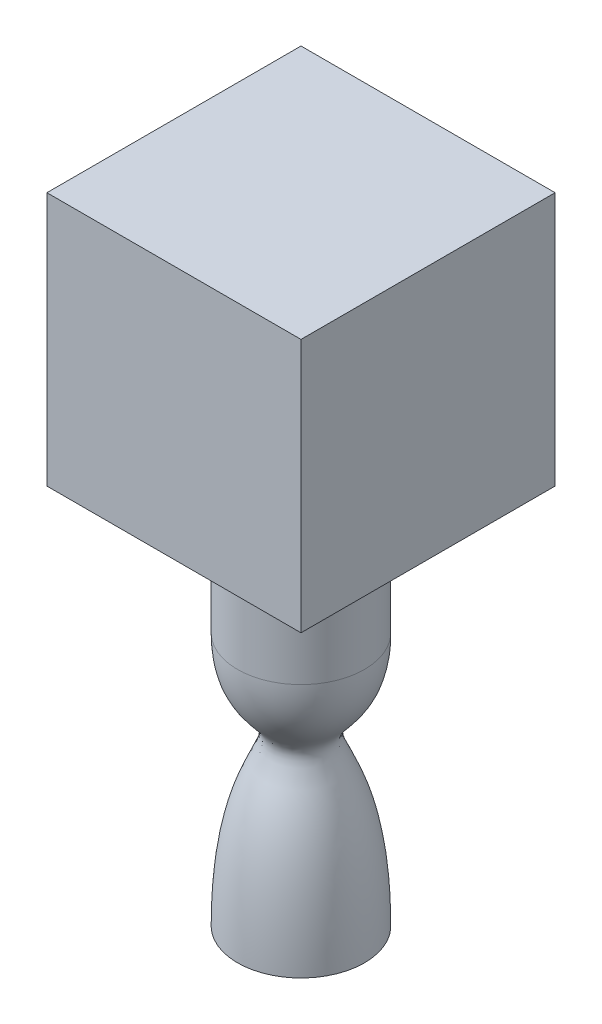
ISO-10303-21;
HEADER;
FILE_DESCRIPTION(('STEP AP214'),'2;1');
FILE_NAME('part.step','',(''),(''),'','','');
FILE_SCHEMA(('AUTOMOTIVE_DESIGN { 1 0 10303 214 1 1 1 1 }'));
ENDSEC;
DATA;
#1=APPLICATION_CONTEXT('core data for automotive mechanical design processes');
#2=APPLICATION_PROTOCOL_DEFINITION('international standard','automotive_design',2000,#1);
#3=PRODUCT_CONTEXT('',#1,'mechanical');
#4=PRODUCT('Part','Part','',(#3));
#5=PRODUCT_RELATED_PRODUCT_CATEGORY('part','',(#4));
#6=PRODUCT_DEFINITION_FORMATION('','',#4);
#7=PRODUCT_DEFINITION_CONTEXT('part definition',#1,'design');
#8=PRODUCT_DEFINITION('design','',#6,#7);
#9=PRODUCT_DEFINITION_SHAPE('','',#8);
#10=(LENGTH_UNIT() NAMED_UNIT(*) SI_UNIT(.MILLI.,.METRE.));
#11=(NAMED_UNIT(*) PLANE_ANGLE_UNIT() SI_UNIT($,.RADIAN.));
#12=(NAMED_UNIT(*) SI_UNIT($,.STERADIAN.) SOLID_ANGLE_UNIT());
#13=UNCERTAINTY_MEASURE_WITH_UNIT(LENGTH_MEASURE(1.E-05),#10,'distance_accuracy_value','');
#14=(GEOMETRIC_REPRESENTATION_CONTEXT(3) GLOBAL_UNCERTAINTY_ASSIGNED_CONTEXT((#13)) GLOBAL_UNIT_ASSIGNED_CONTEXT((#10,
#11,#12)) REPRESENTATION_CONTEXT('',''));
#15=CARTESIAN_POINT('',(0.,0.,0.));
#16=DIRECTION('',(0.,0.,1.));
#17=DIRECTION('',(1.,0.,0.));
#18=AXIS2_PLACEMENT_3D('',#15,#16,#17);
#19=CARTESIAN_POINT('',(50.,-200.,0.));
#20=DIRECTION('',(0.,-1.,0.));
#21=DIRECTION('',(1.,0.,0.));
#22=AXIS2_PLACEMENT_3D('',#19,#20,#21);
#23=CYLINDRICAL_SURFACE('',#22,49.9999999999999);
#24=CARTESIAN_POINT('',(49.9999999999999,100.,0.));
#25=DIRECTION('',(0.,-1.,0.));
#26=DIRECTION('',(1.,0.,0.));
#27=AXIS2_PLACEMENT_3D('',#24,#25,#26);
#28=CIRCLE('',#27,49.9999999999999);
#29=CARTESIAN_POINT('',(99.9999999999997,100.,0.));
#30=VERTEX_POINT('',#29);
#31=EDGE_CURVE('E36',#30,#30,#28,.T.);
#32=ORIENTED_EDGE('',*,*,#31,.T.);
#33=EDGE_LOOP('',(#32));
#34=FACE_BOUND('',#33,.T.);
#35=CARTESIAN_POINT('',(49.9999999999999,0.,0.));
#36=DIRECTION('',(0.,-1.,0.));
#37=DIRECTION('',(1.,0.,0.));
#38=AXIS2_PLACEMENT_3D('',#35,#36,#37);
#39=CIRCLE('',#38,49.9999999999999);
#40=CARTESIAN_POINT('',(99.9999999999999,0.,0.));
#41=VERTEX_POINT('',#40);
#42=EDGE_CURVE('E144',#41,#41,#39,.T.);
#43=ORIENTED_EDGE('',*,*,#42,.F.);
#44=EDGE_LOOP('',(#43));
#45=FACE_BOUND('',#44,.T.);
#46=ADVANCED_FACE('F33',(#34,#45),#23,.T.);
#47=CARTESIAN_POINT('',(5.,0.,0.));
#48=DIRECTION('',(0.,1.,0.));
#49=DIRECTION('',(-1.,0.,0.));
#50=AXIS2_PLACEMENT_3D('',#47,#48,#49);
#51=PLANE('',#50);
#52=CARTESIAN_POINT('',(49.9999999999999,0.,0.));
#53=DIRECTION('',(0.,-1.,0.));
#54=DIRECTION('',(1.,0.,0.));
#55=AXIS2_PLACEMENT_3D('',#52,#53,#54);
#56=CIRCLE('',#55,44.9999999999999);
#57=CARTESIAN_POINT('',(94.9999999999999,0.,0.));
#58=VERTEX_POINT('',#57);
#59=EDGE_CURVE('E11',#58,#58,#56,.T.);
#60=ORIENTED_EDGE('',*,*,#59,.T.);
#61=EDGE_LOOP('',(#60));
#62=FACE_BOUND('',#61,.T.);
#63=ADVANCED_FACE('F126',(#62),#51,.F.);
#64=CARTESIAN_POINT('',(5.,0.,0.));
#65=CARTESIAN_POINT('',(5.,-0.805913512646335,0.));
#66=CARTESIAN_POINT('',(5.01679385683209,-2.44034510138894,0.));
#67=CARTESIAN_POINT('',(5.11409082620936,-5.52735768304128,0.));
#68=CARTESIAN_POINT('',(5.34875079101118,-9.18061701657705,0.));
#69=CARTESIAN_POINT('',(5.79130623237242,-13.2210423798346,0.));
#70=CARTESIAN_POINT('',(6.57082096478203,-18.1971490246142,0.));
#71=CARTESIAN_POINT('',(7.8549430639798,-23.6999324931805,0.));
#72=CARTESIAN_POINT('',(9.76125027606328,-29.3392914858642,0.));
#73=CARTESIAN_POINT('',(11.9225196035146,-34.1802324791216,0.));
#74=CARTESIAN_POINT('',(15.020956898657,-39.7653466346938,0.));
#75=CARTESIAN_POINT('',(19.0982045260745,-45.4405316695129,0.));
#76=CARTESIAN_POINT('',(23.7888580458813,-50.9911728900575,0.));
#77=CARTESIAN_POINT('',(27.8761814206865,-55.9994060101403,0.));
#78=CARTESIAN_POINT('',(30.495062137894,-60.4960328897005,0.));
#79=CARTESIAN_POINT('',(31.6726337632404,-64.6155113745252,0.));
#80=CARTESIAN_POINT('',(31.9639036184022,-67.8651986747506,0.));
#81=CARTESIAN_POINT('',(31.6740451724022,-71.1510118461308,0.));
#82=CARTESIAN_POINT('',(30.6459580885398,-75.5496667091919,0.));
#83=CARTESIAN_POINT('',(28.4044948416877,-81.3015274686586,0.));
#84=CARTESIAN_POINT('',(24.5590316408053,-89.6866977255333,0.));
#85=CARTESIAN_POINT('',(20.6347520711366,-98.8224140830596,0.));
#86=CARTESIAN_POINT('',(17.2968999594476,-108.024070811904,0.));
#87=CARTESIAN_POINT('',(14.7715036229903,-116.04602263642,0.));
#88=CARTESIAN_POINT('',(12.3106312281337,-125.375404850916,0.));
#89=CARTESIAN_POINT('',(10.0137798502451,-136.217854157903,0.));
#90=CARTESIAN_POINT('',(8.32905172077925,-146.701049549262,0.));
#91=CARTESIAN_POINT('',(7.1804133109419,-156.079119991694,0.));
#92=CARTESIAN_POINT('',(6.43504268414012,-163.641363626803,0.));
#93=CARTESIAN_POINT('',(5.82280508402451,-171.766381724919,0.));
#94=CARTESIAN_POINT('',(5.43832401313426,-179.035635061119,0.));
#95=CARTESIAN_POINT('',(5.21535879868279,-185.169118612186,0.));
#96=CARTESIAN_POINT('',(5.09280850531661,-189.931856824614,0.));
#97=CARTESIAN_POINT('',(5.02990434392177,-194.044527701738,0.));
#98=CARTESIAN_POINT('',(5.00433110145666,-197.414073856895,0.));
#99=CARTESIAN_POINT('',(4.99999999999997,-199.141583293985,0.));
#100=CARTESIAN_POINT('',(4.99999999999997,-200.,0.));
#101=B_SPLINE_CURVE_WITH_KNOTS('',3,(#64,#65,#66,#67,#68,#69,#70,#71,#72,#73,#74,#75,#76,#77,
#78,#79,#80,#81,#82,#83,#84,#85,#86,#87,#88,#89,#90,#91,#92,#93,#94,#95,#96,#97,#98,#99,#100),
.UNSPECIFIED.,.F.,.F.,(4,1,1,1,1,1,1,1,1,1,1,1,1,1,1,1,1,1,1,1,1,1,1,1,1,1,1,1,1,1,1,1,1,1,4),
(0.,0.0078125,0.015625,0.03125,0.046875,0.0625,0.09375,0.125,0.15625,0.1875,0.25,0.3125,0.375,
0.4375,0.46875,0.5,0.53125,0.5625,0.625,0.6875,0.75,0.78125,0.8125,0.84375,0.875,0.90625,
0.921875,0.9375,0.953125,0.96875,0.9765625,0.984375,0.9921875,0.99609375,1.),.UNSPECIFIED.);
#102=CARTESIAN_POINT('',(50.,-200.,0.));
#103=DIRECTION('',(0.,-1.,0.));
#104=AXIS1_PLACEMENT('',#102,#103);
#105=SURFACE_OF_REVOLUTION('',#101,#104);
#106=CARTESIAN_POINT('',(50.,-200.,0.));
#107=DIRECTION('',(0.,-1.,0.));
#108=DIRECTION('',(1.,0.,0.));
#109=AXIS2_PLACEMENT_3D('',#106,#107,#108);
#110=CIRCLE('',#109,45.0000000000001);
#111=CARTESIAN_POINT('',(95.0000000000001,-200.,0.));
#112=VERTEX_POINT('',#111);
#113=EDGE_CURVE('E42',#112,#112,#110,.T.);
#114=ORIENTED_EDGE('',*,*,#113,.T.);
#115=EDGE_LOOP('',(#114));
#116=FACE_BOUND('',#115,.T.);
#117=ORIENTED_EDGE('',*,*,#59,.F.);
#118=EDGE_LOOP('',(#117));
#119=FACE_BOUND('',#118,.T.);
#120=ADVANCED_FACE('F122',(#116,#119),#105,.F.);
#121=CARTESIAN_POINT('',(4.99999999999997,-200.,0.));
#122=DIRECTION('',(0.,-1.,0.));
#123=DIRECTION('',(1.,0.,0.));
#124=AXIS2_PLACEMENT_3D('',#121,#122,#123);
#125=PLANE('',#124);
#126=CARTESIAN_POINT('',(50.,-200.,0.));
#127=DIRECTION('',(0.,-1.,0.));
#128=DIRECTION('',(1.,0.,0.));
#129=AXIS2_PLACEMENT_3D('',#126,#127,#128);
#130=CIRCLE('',#129,50.0000000000001);
#131=CARTESIAN_POINT('',(100.,-200.,0.));
#132=VERTEX_POINT('',#131);
#133=EDGE_CURVE('E146',#132,#132,#130,.T.);
#134=ORIENTED_EDGE('',*,*,#133,.T.);
#135=EDGE_LOOP('',(#134));
#136=FACE_BOUND('',#135,.T.);
#137=ORIENTED_EDGE('',*,*,#113,.F.);
#138=EDGE_LOOP('',(#137));
#139=FACE_BOUND('',#138,.T.);
#140=ADVANCED_FACE('F125',(#136,#139),#125,.T.);
#141=CARTESIAN_POINT('',(0.,0.,0.));
#142=CARTESIAN_POINT('',(0.,-65.7293009634948,0.));
#143=CARTESIAN_POINT('',(42.987278242467,-54.5292522333672,0.));
#144=CARTESIAN_POINT('',(42.987278242467,-76.9293496936225,0.));
#145=CARTESIAN_POINT('',(0.,-65.7293009634948,0.));
#146=CARTESIAN_POINT('',(0.,-200.,0.));
#147=B_SPLINE_CURVE_WITH_KNOTS('',5,(#141,#142,#143,#144,#145,#146),.UNSPECIFIED.,.F.,.F.,(6,6),
(0.,1.),.UNSPECIFIED.);
#148=CARTESIAN_POINT('',(50.,-200.,0.));
#149=DIRECTION('',(0.,-1.,0.));
#150=AXIS1_PLACEMENT('',#148,#149);
#151=SURFACE_OF_REVOLUTION('',#147,#150);
#152=ORIENTED_EDGE('',*,*,#133,.F.);
#153=EDGE_LOOP('',(#152));
#154=FACE_BOUND('',#153,.T.);
#155=ORIENTED_EDGE('',*,*,#42,.T.);
#156=EDGE_LOOP('',(#155));
#157=FACE_BOUND('',#156,.T.);
#158=ADVANCED_FACE('F154',(#154,#157),#151,.T.);
#159=CARTESIAN_POINT('',(-50.0000000000002,300.,-100.));
#160=DIRECTION('',(1.,0.,0.));
#161=DIRECTION('',(0.,1.,0.));
#162=AXIS2_PLACEMENT_3D('',#159,#160,#161);
#163=PLANE('',#162);
#164=DIRECTION('',(0.,0.,1.));
#165=VECTOR('',#164,1.);
#166=CARTESIAN_POINT('',(-50.0000000000001,100.,-100.));
#167=LINE('',#166,#165);
#168=CARTESIAN_POINT('',(-50.0000000000001,100.,-100.));
#169=VERTEX_POINT('',#168);
#170=CARTESIAN_POINT('',(-50.0000000000001,100.,100.));
#171=VERTEX_POINT('',#170);
#172=EDGE_CURVE('E101',#169,#171,#167,.T.);
#173=ORIENTED_EDGE('',*,*,#172,.T.);
#174=DIRECTION('',(0.,-1.,0.));
#175=VECTOR('',#174,1.);
#176=CARTESIAN_POINT('',(-50.0000000000002,300.,100.));
#177=LINE('',#176,#175);
#178=CARTESIAN_POINT('',(-50.0000000000002,300.,100.));
#179=VERTEX_POINT('',#178);
#180=EDGE_CURVE('E92',#179,#171,#177,.T.);
#181=ORIENTED_EDGE('',*,*,#180,.F.);
#182=DIRECTION('',(0.,0.,1.));
#183=VECTOR('',#182,1.);
#184=CARTESIAN_POINT('',(-50.0000000000002,300.,-100.));
#185=LINE('',#184,#183);
#186=CARTESIAN_POINT('',(-50.0000000000002,300.,-100.));
#187=VERTEX_POINT('',#186);
#188=EDGE_CURVE('E86',#187,#179,#185,.T.);
#189=ORIENTED_EDGE('',*,*,#188,.F.);
#190=DIRECTION('',(0.,-1.,0.));
#191=VECTOR('',#190,1.);
#192=CARTESIAN_POINT('',(-50.0000000000002,300.,-100.));
#193=LINE('',#192,#191);
#194=EDGE_CURVE('E97',#187,#169,#193,.T.);
#195=ORIENTED_EDGE('',*,*,#194,.T.);
#196=EDGE_LOOP('',(#173,#181,#189,#195));
#197=FACE_BOUND('',#196,.T.);
#198=ADVANCED_FACE('F159',(#197),#163,.F.);
#199=CARTESIAN_POINT('',(150.,300.,100.));
#200=DIRECTION('',(0.,0.,-1.));
#201=DIRECTION('',(-1.,0.,0.));
#202=AXIS2_PLACEMENT_3D('',#199,#200,#201);
#203=PLANE('',#202);
#204=DIRECTION('',(1.,0.,0.));
#205=VECTOR('',#204,1.);
#206=CARTESIAN_POINT('',(150.,100.,100.));
#207=LINE('',#206,#205);
#208=CARTESIAN_POINT('',(150.,100.,100.));
#209=VERTEX_POINT('',#208);
#210=EDGE_CURVE('E91',#171,#209,#207,.T.);
#211=ORIENTED_EDGE('',*,*,#210,.T.);
#212=DIRECTION('',(0.,-1.,0.));
#213=VECTOR('',#212,1.);
#214=CARTESIAN_POINT('',(150.,300.,100.));
#215=LINE('',#214,#213);
#216=CARTESIAN_POINT('',(150.,300.,100.));
#217=VERTEX_POINT('',#216);
#218=EDGE_CURVE('E89',#217,#209,#215,.T.);
#219=ORIENTED_EDGE('',*,*,#218,.F.);
#220=DIRECTION('',(1.,0.,0.));
#221=VECTOR('',#220,1.);
#222=CARTESIAN_POINT('',(150.,300.,100.));
#223=LINE('',#222,#221);
#224=EDGE_CURVE('E81',#179,#217,#223,.T.);
#225=ORIENTED_EDGE('',*,*,#224,.F.);
#226=ORIENTED_EDGE('',*,*,#180,.T.);
#227=EDGE_LOOP('',(#211,#219,#225,#226));
#228=FACE_BOUND('',#227,.T.);
#229=ADVANCED_FACE('F90',(#228),#203,.F.);
#230=CARTESIAN_POINT('',(150.,300.,-100.));
#231=DIRECTION('',(-1.,0.,0.));
#232=DIRECTION('',(0.,-1.,0.));
#233=AXIS2_PLACEMENT_3D('',#230,#231,#232);
#234=PLANE('',#233);
#235=DIRECTION('',(0.,0.,-1.));
#236=VECTOR('',#235,1.);
#237=CARTESIAN_POINT('',(150.,100.,-100.));
#238=LINE('',#237,#236);
#239=CARTESIAN_POINT('',(150.,100.,-100.));
#240=VERTEX_POINT('',#239);
#241=EDGE_CURVE('E67',#209,#240,#238,.T.);
#242=ORIENTED_EDGE('',*,*,#241,.T.);
#243=DIRECTION('',(0.,-1.,0.));
#244=VECTOR('',#243,1.);
#245=CARTESIAN_POINT('',(150.,300.,-100.));
#246=LINE('',#245,#244);
#247=CARTESIAN_POINT('',(150.,300.,-100.));
#248=VERTEX_POINT('',#247);
#249=EDGE_CURVE('E93',#248,#240,#246,.T.);
#250=ORIENTED_EDGE('',*,*,#249,.F.);
#251=DIRECTION('',(0.,0.,-1.));
#252=VECTOR('',#251,1.);
#253=CARTESIAN_POINT('',(150.,300.,-100.));
#254=LINE('',#253,#252);
#255=EDGE_CURVE('E84',#217,#248,#254,.T.);
#256=ORIENTED_EDGE('',*,*,#255,.F.);
#257=ORIENTED_EDGE('',*,*,#218,.T.);
#258=EDGE_LOOP('',(#242,#250,#256,#257));
#259=FACE_BOUND('',#258,.T.);
#260=ADVANCED_FACE('F95',(#259),#234,.F.);
#261=CARTESIAN_POINT('',(150.,300.,-100.));
#262=DIRECTION('',(0.,0.,1.));
#263=DIRECTION('',(1.,0.,0.));
#264=AXIS2_PLACEMENT_3D('',#261,#262,#263);
#265=PLANE('',#264);
#266=DIRECTION('',(-1.,0.,0.));
#267=VECTOR('',#266,1.);
#268=CARTESIAN_POINT('',(150.,100.,-100.));
#269=LINE('',#268,#267);
#270=EDGE_CURVE('E73',#240,#169,#269,.T.);
#271=ORIENTED_EDGE('',*,*,#270,.T.);
#272=ORIENTED_EDGE('',*,*,#194,.F.);
#273=DIRECTION('',(-1.,0.,0.));
#274=VECTOR('',#273,1.);
#275=CARTESIAN_POINT('',(150.,300.,-100.));
#276=LINE('',#275,#274);
#277=EDGE_CURVE('E50',#248,#187,#276,.T.);
#278=ORIENTED_EDGE('',*,*,#277,.F.);
#279=ORIENTED_EDGE('',*,*,#249,.T.);
#280=EDGE_LOOP('',(#271,#272,#278,#279));
#281=FACE_BOUND('',#280,.T.);
#282=ADVANCED_FACE('F172',(#281),#265,.F.);
#283=CARTESIAN_POINT('',(-1.66533453693773E-13,300.,0.));
#284=DIRECTION('',(0.,-1.,0.));
#285=DIRECTION('',(1.,0.,0.));
#286=AXIS2_PLACEMENT_3D('',#283,#284,#285);
#287=PLANE('',#286);
#288=ORIENTED_EDGE('',*,*,#188,.T.);
#289=ORIENTED_EDGE('',*,*,#224,.T.);
#290=ORIENTED_EDGE('',*,*,#255,.T.);
#291=ORIENTED_EDGE('',*,*,#277,.T.);
#292=EDGE_LOOP('',(#288,#289,#290,#291));
#293=FACE_BOUND('',#292,.T.);
#294=ADVANCED_FACE('F82',(#293),#287,.F.);
#295=CARTESIAN_POINT('',(0.,100.,0.));
#296=DIRECTION('',(0.,-1.,0.));
#297=DIRECTION('',(1.,0.,0.));
#298=AXIS2_PLACEMENT_3D('',#295,#296,#297);
#299=PLANE('',#298);
#300=ORIENTED_EDGE('',*,*,#31,.F.);
#301=EDGE_LOOP('',(#300));
#302=FACE_BOUND('',#301,.T.);
#303=ORIENTED_EDGE('',*,*,#172,.F.);
#304=ORIENTED_EDGE('',*,*,#270,.F.);
#305=ORIENTED_EDGE('',*,*,#241,.F.);
#306=ORIENTED_EDGE('',*,*,#210,.F.);
#307=EDGE_LOOP('',(#303,#304,#305,#306));
#308=FACE_BOUND('',#307,.T.);
#309=ADVANCED_FACE('F175',(#302,#308),#299,.T.);
#310=CLOSED_SHELL('',(#46,#63,#120,#140,#158,#198,#229,#260,#282,#294,#309));
#311=MANIFOLD_SOLID_BREP('B2',#310);
#312=ADVANCED_BREP_SHAPE_REPRESENTATION('',(#18,#311),#14);
#313=SHAPE_DEFINITION_REPRESENTATION(#9,#312);
ENDSEC;
END-ISO-10303-21;
